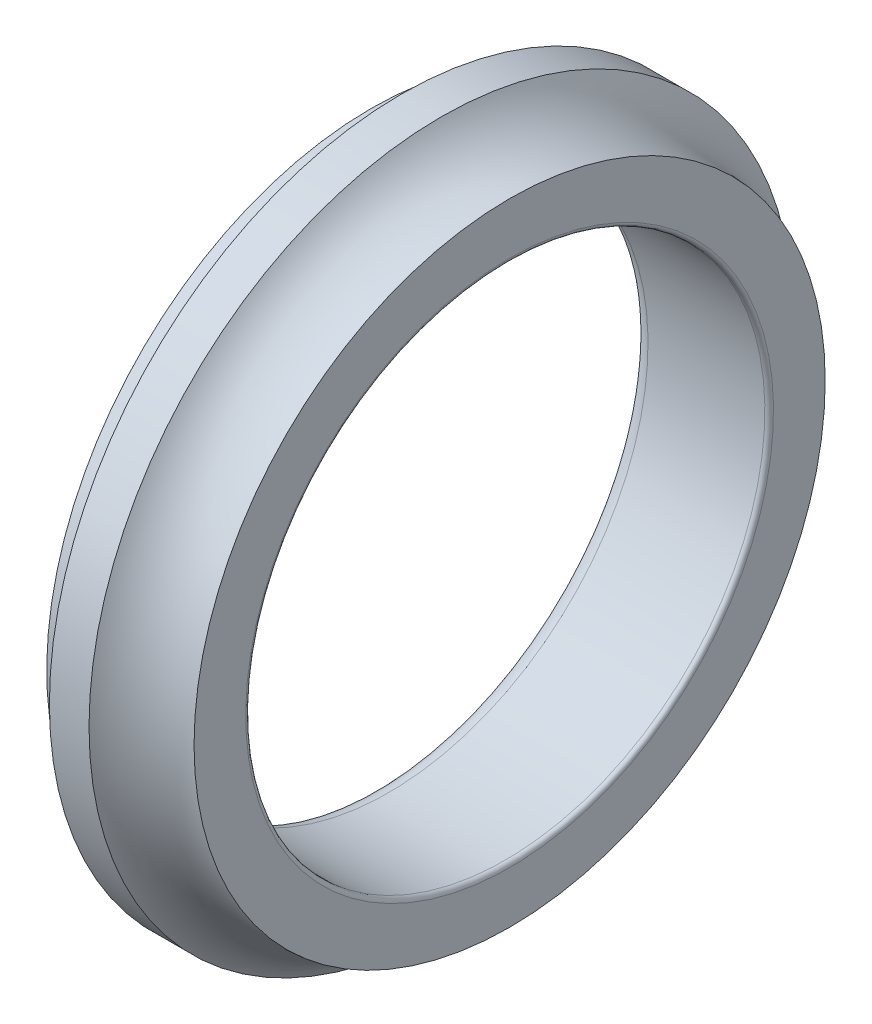
ISO-10303-21;
HEADER;
FILE_DESCRIPTION(('STEP AP214'),'2;1');
FILE_NAME('part.step','',(''),(''),'','','');
FILE_SCHEMA(('AUTOMOTIVE_DESIGN { 1 0 10303 214 1 1 1 1 }'));
ENDSEC;
DATA;
#1=APPLICATION_CONTEXT('core data for automotive mechanical design processes');
#2=APPLICATION_PROTOCOL_DEFINITION('international standard','automotive_design',2000,#1);
#3=PRODUCT_CONTEXT('',#1,'mechanical');
#4=PRODUCT('Part','Part','',(#3));
#5=PRODUCT_RELATED_PRODUCT_CATEGORY('part','',(#4));
#6=PRODUCT_DEFINITION_FORMATION('','',#4);
#7=PRODUCT_DEFINITION_CONTEXT('part definition',#1,'design');
#8=PRODUCT_DEFINITION('design','',#6,#7);
#9=PRODUCT_DEFINITION_SHAPE('','',#8);
#10=(LENGTH_UNIT() NAMED_UNIT(*) SI_UNIT(.MILLI.,.METRE.));
#11=(NAMED_UNIT(*) PLANE_ANGLE_UNIT() SI_UNIT($,.RADIAN.));
#12=(NAMED_UNIT(*) SI_UNIT($,.STERADIAN.) SOLID_ANGLE_UNIT());
#13=UNCERTAINTY_MEASURE_WITH_UNIT(LENGTH_MEASURE(1.E-05),#10,'distance_accuracy_value','');
#14=(GEOMETRIC_REPRESENTATION_CONTEXT(3) GLOBAL_UNCERTAINTY_ASSIGNED_CONTEXT((#13)) GLOBAL_UNIT_ASSIGNED_CONTEXT((#10,
#11,#12)) REPRESENTATION_CONTEXT('',''));
#15=CARTESIAN_POINT('',(0.,0.,0.));
#16=DIRECTION('',(0.,0.,1.));
#17=DIRECTION('',(1.,0.,0.));
#18=AXIS2_PLACEMENT_3D('',#15,#16,#17);
#19=CARTESIAN_POINT('',(8.,0.,0.));
#20=DIRECTION('',(1.,0.,0.));
#21=DIRECTION('',(0.,0.,-1.));
#22=AXIS2_PLACEMENT_3D('',#19,#20,#21);
#23=TOROIDAL_SURFACE('',#22,23.,4.7625);
#24=CARTESIAN_POINT('',(4.04286640988708,0.,0.));
#25=DIRECTION('',(1.,0.,0.));
#26=DIRECTION('',(0.,1.,0.));
#27=AXIS2_PLACEMENT_3D('',#24,#25,#26);
#28=CIRCLE('',#27,20.35);
#29=CARTESIAN_POINT('',(4.04286640988708,20.35,0.));
#30=VERTEX_POINT('',#29);
#31=EDGE_CURVE('E11',#30,#30,#28,.T.);
#32=ORIENTED_EDGE('',*,*,#31,.T.);
#33=EDGE_LOOP('',(#32));
#34=FACE_BOUND('',#33,.T.);
#35=CARTESIAN_POINT('',(8.,0.,0.));
#36=DIRECTION('',(1.,0.,0.));
#37=DIRECTION('',(0.,1.,0.));
#38=AXIS2_PLACEMENT_3D('',#35,#36,#37);
#39=CIRCLE('',#38,18.2375);
#40=CARTESIAN_POINT('',(8.,18.2375,0.));
#41=VERTEX_POINT('',#40);
#42=EDGE_CURVE('E20',#41,#41,#39,.T.);
#43=ORIENTED_EDGE('',*,*,#42,.F.);
#44=EDGE_LOOP('',(#43));
#45=FACE_BOUND('',#44,.T.);
#46=ADVANCED_FACE('F16',(#34,#45),#23,.F.);
#47=CARTESIAN_POINT('',(2.89813464198123,0.,0.));
#48=DIRECTION('',(-1.,0.,0.));
#49=DIRECTION('',(0.,1.,0.));
#50=AXIS2_PLACEMENT_3D('',#47,#48,#49);
#51=CYLINDRICAL_SURFACE('',#50,20.35);
#52=CARTESIAN_POINT('',(1.75340287407537,0.,0.));
#53=DIRECTION('',(1.,0.,0.));
#54=DIRECTION('',(0.,1.,0.));
#55=AXIS2_PLACEMENT_3D('',#52,#53,#54);
#56=CIRCLE('',#55,20.35);
#57=CARTESIAN_POINT('',(1.75340287407537,20.35,0.));
#58=VERTEX_POINT('',#57);
#59=EDGE_CURVE('E25',#58,#58,#56,.T.);
#60=ORIENTED_EDGE('',*,*,#59,.T.);
#61=EDGE_LOOP('',(#60));
#62=FACE_BOUND('',#61,.T.);
#63=ORIENTED_EDGE('',*,*,#31,.F.);
#64=EDGE_LOOP('',(#63));
#65=FACE_BOUND('',#64,.T.);
#66=ADVANCED_FACE('F92',(#62,#65),#51,.T.);
#67=CARTESIAN_POINT('',(1.67062453824257,0.,0.));
#68=DIRECTION('',(1.,0.,0.));
#69=DIRECTION('',(0.,1.,0.));
#70=AXIS2_PLACEMENT_3D('',#67,#68,#69);
#71=CONICAL_SURFACE('',#70,19.8805407289332,1.39626340159546);
#72=CARTESIAN_POINT('',(1.58784620240977,0.,0.));
#73=DIRECTION('',(1.,0.,0.));
#74=DIRECTION('',(0.,1.,0.));
#75=AXIS2_PLACEMENT_3D('',#72,#73,#74);
#76=CIRCLE('',#75,19.4110814578664);
#77=CARTESIAN_POINT('',(1.58784620240977,19.4110814578664,0.));
#78=VERTEX_POINT('',#77);
#79=EDGE_CURVE('E66',#78,#78,#76,.T.);
#80=ORIENTED_EDGE('',*,*,#79,.T.);
#81=EDGE_LOOP('',(#80));
#82=FACE_BOUND('',#81,.T.);
#83=ORIENTED_EDGE('',*,*,#59,.F.);
#84=EDGE_LOOP('',(#83));
#85=FACE_BOUND('',#84,.T.);
#86=ADVANCED_FACE('F78',(#82,#85),#71,.T.);
#87=CARTESIAN_POINT('',(0.8,0.,0.));
#88=DIRECTION('',(1.,0.,0.));
#89=DIRECTION('',(0.,0.,-1.));
#90=AXIS2_PLACEMENT_3D('',#87,#88,#89);
#91=TOROIDAL_SURFACE('',#90,19.55,0.8);
#92=CARTESIAN_POINT('',(0.8,0.,0.));
#93=DIRECTION('',(1.,0.,0.));
#94=DIRECTION('',(0.,1.,0.));
#95=AXIS2_PLACEMENT_3D('',#92,#93,#94);
#96=CIRCLE('',#95,18.75);
#97=CARTESIAN_POINT('',(0.8,18.75,0.));
#98=VERTEX_POINT('',#97);
#99=EDGE_CURVE('E63',#98,#98,#96,.T.);
#100=ORIENTED_EDGE('',*,*,#99,.T.);
#101=EDGE_LOOP('',(#100));
#102=FACE_BOUND('',#101,.T.);
#103=ORIENTED_EDGE('',*,*,#79,.F.);
#104=EDGE_LOOP('',(#103));
#105=FACE_BOUND('',#104,.T.);
#106=ADVANCED_FACE('F81',(#102,#105),#91,.F.);
#107=CARTESIAN_POINT('',(0.4,0.,0.));
#108=DIRECTION('',(-1.,0.,0.));
#109=DIRECTION('',(0.,1.,0.));
#110=AXIS2_PLACEMENT_3D('',#107,#108,#109);
#111=CYLINDRICAL_SURFACE('',#110,18.75);
#112=CARTESIAN_POINT('',(0.,0.,0.));
#113=DIRECTION('',(1.,0.,0.));
#114=DIRECTION('',(0.,1.,0.));
#115=AXIS2_PLACEMENT_3D('',#112,#113,#114);
#116=CIRCLE('',#115,18.75);
#117=CARTESIAN_POINT('',(0.,18.75,0.));
#118=VERTEX_POINT('',#117);
#119=EDGE_CURVE('E59',#118,#118,#116,.T.);
#120=ORIENTED_EDGE('',*,*,#119,.T.);
#121=EDGE_LOOP('',(#120));
#122=FACE_BOUND('',#121,.T.);
#123=ORIENTED_EDGE('',*,*,#99,.F.);
#124=EDGE_LOOP('',(#123));
#125=FACE_BOUND('',#124,.T.);
#126=ADVANCED_FACE('F60',(#122,#125),#111,.T.);
#127=CARTESIAN_POINT('',(0.,17.375,0.));
#128=DIRECTION('',(-1.,0.,0.));
#129=DIRECTION('',(0.,-1.,0.));
#130=AXIS2_PLACEMENT_3D('',#127,#128,#129);
#131=PLANE('',#130);
#132=CARTESIAN_POINT('',(0.,0.,0.));
#133=DIRECTION('',(1.,0.,0.));
#134=DIRECTION('',(0.,1.,0.));
#135=AXIS2_PLACEMENT_3D('',#132,#133,#134);
#136=CIRCLE('',#135,16.);
#137=CARTESIAN_POINT('',(0.,16.,0.));
#138=VERTEX_POINT('',#137);
#139=EDGE_CURVE('E64',#138,#138,#136,.T.);
#140=ORIENTED_EDGE('',*,*,#139,.T.);
#141=EDGE_LOOP('',(#140));
#142=FACE_BOUND('',#141,.T.);
#143=ORIENTED_EDGE('',*,*,#119,.F.);
#144=EDGE_LOOP('',(#143));
#145=FACE_BOUND('',#144,.T.);
#146=ADVANCED_FACE('F90',(#142,#145),#131,.T.);
#147=CARTESIAN_POINT('',(1.,0.,0.));
#148=DIRECTION('',(1.,0.,0.));
#149=DIRECTION('',(0.,0.,-1.));
#150=AXIS2_PLACEMENT_3D('',#147,#148,#149);
#151=TOROIDAL_SURFACE('',#150,16.,1.);
#152=CARTESIAN_POINT('',(1.,0.,0.));
#153=DIRECTION('',(1.,0.,0.));
#154=DIRECTION('',(0.,1.,0.));
#155=AXIS2_PLACEMENT_3D('',#152,#153,#154);
#156=CIRCLE('',#155,15.);
#157=CARTESIAN_POINT('',(1.,15.,0.));
#158=VERTEX_POINT('',#157);
#159=EDGE_CURVE('E67',#158,#158,#156,.T.);
#160=ORIENTED_EDGE('',*,*,#159,.T.);
#161=EDGE_LOOP('',(#160));
#162=FACE_BOUND('',#161,.T.);
#163=ORIENTED_EDGE('',*,*,#139,.F.);
#164=EDGE_LOOP('',(#163));
#165=FACE_BOUND('',#164,.T.);
#166=ADVANCED_FACE('F103',(#162,#165),#151,.T.);
#167=CARTESIAN_POINT('',(4.375,0.,0.));
#168=DIRECTION('',(-1.,0.,0.));
#169=DIRECTION('',(0.,1.,0.));
#170=AXIS2_PLACEMENT_3D('',#167,#168,#169);
#171=CYLINDRICAL_SURFACE('',#170,15.);
#172=CARTESIAN_POINT('',(7.75,0.,0.));
#173=DIRECTION('',(1.,0.,0.));
#174=DIRECTION('',(0.,1.,0.));
#175=AXIS2_PLACEMENT_3D('',#172,#173,#174);
#176=CIRCLE('',#175,15.);
#177=CARTESIAN_POINT('',(7.75,15.,0.));
#178=VERTEX_POINT('',#177);
#179=EDGE_CURVE('E71',#178,#178,#176,.T.);
#180=ORIENTED_EDGE('',*,*,#179,.T.);
#181=EDGE_LOOP('',(#180));
#182=FACE_BOUND('',#181,.T.);
#183=ORIENTED_EDGE('',*,*,#159,.F.);
#184=EDGE_LOOP('',(#183));
#185=FACE_BOUND('',#184,.T.);
#186=ADVANCED_FACE('F112',(#182,#185),#171,.F.);
#187=CARTESIAN_POINT('',(7.75,0.,0.));
#188=DIRECTION('',(1.,0.,0.));
#189=DIRECTION('',(0.,0.,-1.));
#190=AXIS2_PLACEMENT_3D('',#187,#188,#189);
#191=TOROIDAL_SURFACE('',#190,15.25,0.25);
#192=CARTESIAN_POINT('',(8.,0.,0.));
#193=DIRECTION('',(1.,0.,0.));
#194=DIRECTION('',(0.,1.,0.));
#195=AXIS2_PLACEMENT_3D('',#192,#193,#194);
#196=CIRCLE('',#195,15.25);
#197=CARTESIAN_POINT('',(8.,15.25,0.));
#198=VERTEX_POINT('',#197);
#199=EDGE_CURVE('E72',#198,#198,#196,.T.);
#200=ORIENTED_EDGE('',*,*,#199,.T.);
#201=EDGE_LOOP('',(#200));
#202=FACE_BOUND('',#201,.T.);
#203=ORIENTED_EDGE('',*,*,#179,.F.);
#204=EDGE_LOOP('',(#203));
#205=FACE_BOUND('',#204,.T.);
#206=ADVANCED_FACE('F18',(#202,#205),#191,.T.);
#207=CARTESIAN_POINT('',(8.,16.74375,0.));
#208=DIRECTION('',(1.,0.,0.));
#209=DIRECTION('',(0.,1.,0.));
#210=AXIS2_PLACEMENT_3D('',#207,#208,#209);
#211=PLANE('',#210);
#212=ORIENTED_EDGE('',*,*,#42,.T.);
#213=EDGE_LOOP('',(#212));
#214=FACE_BOUND('',#213,.T.);
#215=ORIENTED_EDGE('',*,*,#199,.F.);
#216=EDGE_LOOP('',(#215));
#217=FACE_BOUND('',#216,.T.);
#218=ADVANCED_FACE('F106',(#214,#217),#211,.T.);
#219=CLOSED_SHELL('',(#46,#66,#86,#106,#126,#146,#166,#186,#206,#218));
#220=MANIFOLD_SOLID_BREP('B1',#219);
#221=ADVANCED_BREP_SHAPE_REPRESENTATION('',(#18,#220),#14);
#222=SHAPE_DEFINITION_REPRESENTATION(#9,#221);
ENDSEC;
END-ISO-10303-21;
